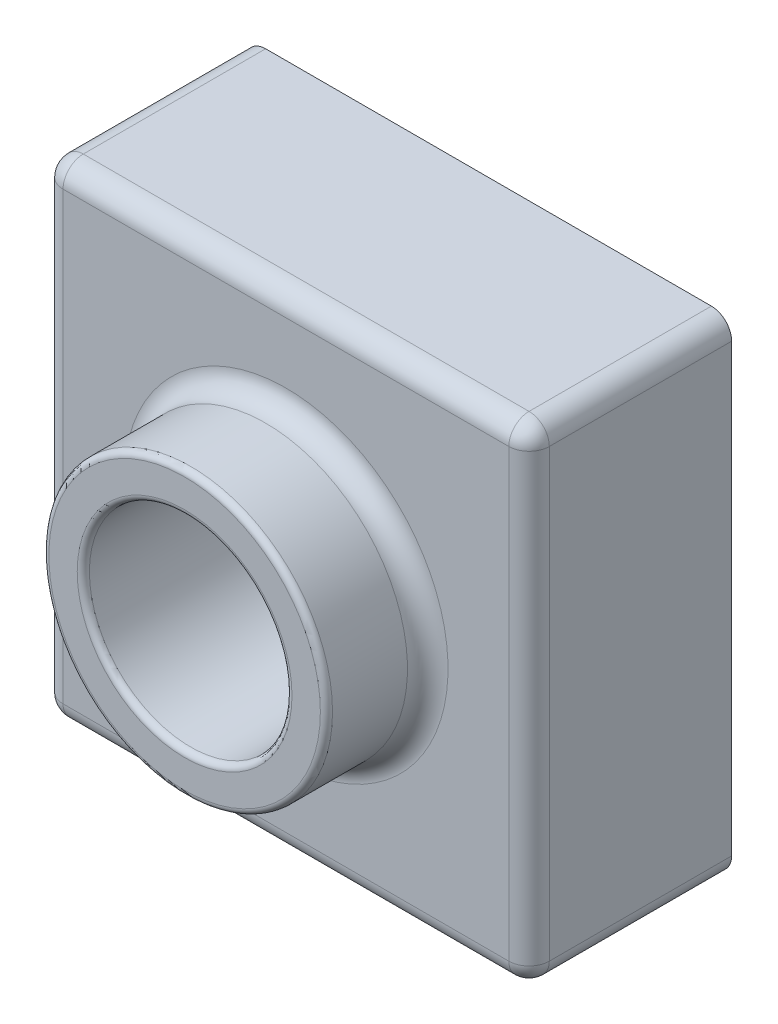
ISO-10303-21;
HEADER;
FILE_DESCRIPTION(('STEP AP214'),'2;1');
FILE_NAME('part.step','',(''),(''),'','','');
FILE_SCHEMA(('AUTOMOTIVE_DESIGN { 1 0 10303 214 1 1 1 1 }'));
ENDSEC;
DATA;
#1=APPLICATION_CONTEXT('core data for automotive mechanical design processes');
#2=APPLICATION_PROTOCOL_DEFINITION('international standard','automotive_design',2000,#1);
#3=PRODUCT_CONTEXT('',#1,'mechanical');
#4=PRODUCT('Part','Part','',(#3));
#5=PRODUCT_RELATED_PRODUCT_CATEGORY('part','',(#4));
#6=PRODUCT_DEFINITION_FORMATION('','',#4);
#7=PRODUCT_DEFINITION_CONTEXT('part definition',#1,'design');
#8=PRODUCT_DEFINITION('design','',#6,#7);
#9=PRODUCT_DEFINITION_SHAPE('','',#8);
#10=(LENGTH_UNIT() NAMED_UNIT(*) SI_UNIT(.MILLI.,.METRE.));
#11=(NAMED_UNIT(*) PLANE_ANGLE_UNIT() SI_UNIT($,.RADIAN.));
#12=(NAMED_UNIT(*) SI_UNIT($,.STERADIAN.) SOLID_ANGLE_UNIT());
#13=UNCERTAINTY_MEASURE_WITH_UNIT(LENGTH_MEASURE(1.E-05),#10,'distance_accuracy_value','');
#14=(GEOMETRIC_REPRESENTATION_CONTEXT(3) GLOBAL_UNCERTAINTY_ASSIGNED_CONTEXT((#13)) GLOBAL_UNIT_ASSIGNED_CONTEXT((#10,
#11,#12)) REPRESENTATION_CONTEXT('',''));
#15=CARTESIAN_POINT('',(0.,0.,0.));
#16=DIRECTION('',(0.,0.,1.));
#17=DIRECTION('',(1.,0.,0.));
#18=AXIS2_PLACEMENT_3D('',#15,#16,#17);
#19=CARTESIAN_POINT('',(0.,120.,0.));
#20=DIRECTION('',(0.,0.,-1.));
#21=DIRECTION('',(-1.,0.,0.));
#22=AXIS2_PLACEMENT_3D('',#19,#20,#21);
#23=PLANE('',#22);
#24=DIRECTION('',(1.,0.,0.));
#25=VECTOR('',#24,1.);
#26=CARTESIAN_POINT('',(0.,0.,0.));
#27=LINE('',#26,#25);
#28=CARTESIAN_POINT('',(5.,0.,0.));
#29=VERTEX_POINT('',#28);
#30=CARTESIAN_POINT('',(115.,0.,0.));
#31=VERTEX_POINT('',#30);
#32=EDGE_CURVE('E353',#29,#31,#27,.T.);
#33=ORIENTED_EDGE('',*,*,#32,.F.);
#34=CARTESIAN_POINT('',(5.,5.,0.));
#35=DIRECTION('',(0.,0.,-1.));
#36=DIRECTION('',(-1.,0.,0.));
#37=AXIS2_PLACEMENT_3D('',#34,#35,#36);
#38=CIRCLE('',#37,5.);
#39=CARTESIAN_POINT('',(0.,5.,0.));
#40=VERTEX_POINT('',#39);
#41=EDGE_CURVE('E431',#29,#40,#38,.T.);
#42=ORIENTED_EDGE('',*,*,#41,.T.);
#43=DIRECTION('',(0.,-1.,0.));
#44=VECTOR('',#43,1.);
#45=CARTESIAN_POINT('',(0.,0.,0.));
#46=LINE('',#45,#44);
#47=CARTESIAN_POINT('',(0.,115.,0.));
#48=VERTEX_POINT('',#47);
#49=EDGE_CURVE('E349',#48,#40,#46,.T.);
#50=ORIENTED_EDGE('',*,*,#49,.F.);
#51=CARTESIAN_POINT('',(5.,115.,0.));
#52=DIRECTION('',(0.,0.,-1.));
#53=DIRECTION('',(-1.,0.,0.));
#54=AXIS2_PLACEMENT_3D('',#51,#52,#53);
#55=CIRCLE('',#54,5.);
#56=CARTESIAN_POINT('',(5.,120.,0.));
#57=VERTEX_POINT('',#56);
#58=EDGE_CURVE('E422',#48,#57,#55,.T.);
#59=ORIENTED_EDGE('',*,*,#58,.T.);
#60=DIRECTION('',(-1.,0.,0.));
#61=VECTOR('',#60,1.);
#62=CARTESIAN_POINT('',(0.,120.,0.));
#63=LINE('',#62,#61);
#64=CARTESIAN_POINT('',(115.,120.,0.));
#65=VERTEX_POINT('',#64);
#66=EDGE_CURVE('E361',#65,#57,#63,.T.);
#67=ORIENTED_EDGE('',*,*,#66,.F.);
#68=CARTESIAN_POINT('',(115.,115.,0.));
#69=DIRECTION('',(0.,0.,-1.));
#70=DIRECTION('',(-1.,0.,0.));
#71=AXIS2_PLACEMENT_3D('',#68,#69,#70);
#72=CIRCLE('',#71,5.);
#73=CARTESIAN_POINT('',(120.,115.,0.));
#74=VERTEX_POINT('',#73);
#75=EDGE_CURVE('E425',#65,#74,#72,.T.);
#76=ORIENTED_EDGE('',*,*,#75,.T.);
#77=DIRECTION('',(0.,1.,0.));
#78=VECTOR('',#77,1.);
#79=CARTESIAN_POINT('',(120.,0.,0.));
#80=LINE('',#79,#78);
#81=CARTESIAN_POINT('',(120.,5.,0.));
#82=VERTEX_POINT('',#81);
#83=EDGE_CURVE('E357',#82,#74,#80,.T.);
#84=ORIENTED_EDGE('',*,*,#83,.F.);
#85=CARTESIAN_POINT('',(115.,5.,0.));
#86=DIRECTION('',(0.,0.,-1.));
#87=DIRECTION('',(-1.,0.,0.));
#88=AXIS2_PLACEMENT_3D('',#85,#86,#87);
#89=CIRCLE('',#88,5.);
#90=EDGE_CURVE('E428',#82,#31,#89,.T.);
#91=ORIENTED_EDGE('',*,*,#90,.T.);
#92=EDGE_LOOP('',(#33,#42,#50,#59,#67,#76,#84,#91));
#93=FACE_BOUND('',#92,.T.);
#94=CARTESIAN_POINT('',(5.,5.,0.));
#95=DIRECTION('',(0.,0.,-1.));
#96=DIRECTION('',(-1.,0.,0.));
#97=AXIS2_PLACEMENT_3D('',#94,#95,#96);
#98=CIRCLE('',#97,3.);
#99=CARTESIAN_POINT('',(5.,2.,0.));
#100=VERTEX_POINT('',#99);
#101=CARTESIAN_POINT('',(2.,5.,0.));
#102=VERTEX_POINT('',#101);
#103=EDGE_CURVE('E246',#100,#102,#98,.T.);
#104=ORIENTED_EDGE('',*,*,#103,.F.);
#105=DIRECTION('',(1.,0.,0.));
#106=VECTOR('',#105,1.);
#107=CARTESIAN_POINT('',(0.,2.,0.));
#108=LINE('',#107,#106);
#109=CARTESIAN_POINT('',(115.,2.,0.));
#110=VERTEX_POINT('',#109);
#111=EDGE_CURVE('E323',#100,#110,#108,.T.);
#112=ORIENTED_EDGE('',*,*,#111,.T.);
#113=CARTESIAN_POINT('',(115.,5.,0.));
#114=DIRECTION('',(0.,0.,-1.));
#115=DIRECTION('',(-1.,0.,0.));
#116=AXIS2_PLACEMENT_3D('',#113,#114,#115);
#117=CIRCLE('',#116,3.);
#118=CARTESIAN_POINT('',(118.,5.,0.));
#119=VERTEX_POINT('',#118);
#120=EDGE_CURVE('E329',#119,#110,#117,.T.);
#121=ORIENTED_EDGE('',*,*,#120,.F.);
#122=DIRECTION('',(0.,1.,0.));
#123=VECTOR('',#122,1.);
#124=CARTESIAN_POINT('',(118.,120.,0.));
#125=LINE('',#124,#123);
#126=CARTESIAN_POINT('',(118.,115.,0.));
#127=VERTEX_POINT('',#126);
#128=EDGE_CURVE('E61',#119,#127,#125,.T.);
#129=ORIENTED_EDGE('',*,*,#128,.T.);
#130=CARTESIAN_POINT('',(115.,115.,0.));
#131=DIRECTION('',(0.,0.,-1.));
#132=DIRECTION('',(-1.,0.,0.));
#133=AXIS2_PLACEMENT_3D('',#130,#131,#132);
#134=CIRCLE('',#133,3.);
#135=CARTESIAN_POINT('',(115.,118.,0.));
#136=VERTEX_POINT('',#135);
#137=EDGE_CURVE('E335',#136,#127,#134,.T.);
#138=ORIENTED_EDGE('',*,*,#137,.F.);
#139=DIRECTION('',(-1.,0.,0.));
#140=VECTOR('',#139,1.);
#141=CARTESIAN_POINT('',(0.,118.,0.));
#142=LINE('',#141,#140);
#143=CARTESIAN_POINT('',(5.,118.,0.));
#144=VERTEX_POINT('',#143);
#145=EDGE_CURVE('E240',#136,#144,#142,.T.);
#146=ORIENTED_EDGE('',*,*,#145,.T.);
#147=CARTESIAN_POINT('',(5.,115.,0.));
#148=DIRECTION('',(0.,0.,-1.));
#149=DIRECTION('',(-1.,0.,0.));
#150=AXIS2_PLACEMENT_3D('',#147,#148,#149);
#151=CIRCLE('',#150,3.);
#152=CARTESIAN_POINT('',(2.,115.,0.));
#153=VERTEX_POINT('',#152);
#154=EDGE_CURVE('E305',#153,#144,#151,.T.);
#155=ORIENTED_EDGE('',*,*,#154,.F.);
#156=DIRECTION('',(0.,-1.,0.));
#157=VECTOR('',#156,1.);
#158=CARTESIAN_POINT('',(2.,120.,0.));
#159=LINE('',#158,#157);
#160=EDGE_CURVE('E322',#153,#102,#159,.T.);
#161=ORIENTED_EDGE('',*,*,#160,.T.);
#162=EDGE_LOOP('',(#104,#112,#121,#129,#138,#146,#155,#161));
#163=FACE_BOUND('',#162,.T.);
#164=ADVANCED_FACE('F45',(#93,#163),#23,.T.);
#165=CARTESIAN_POINT('',(0.,120.,50.));
#166=DIRECTION('',(0.,0.,-1.));
#167=DIRECTION('',(-1.,0.,0.));
#168=AXIS2_PLACEMENT_3D('',#165,#166,#167);
#169=PLANE('',#168);
#170=CARTESIAN_POINT('',(60.,60.,50.));
#171=DIRECTION('',(0.,0.,-1.));
#172=DIRECTION('',(-1.,0.,0.));
#173=AXIS2_PLACEMENT_3D('',#170,#171,#172);
#174=CIRCLE('',#173,40.);
#175=CARTESIAN_POINT('',(20.,60.,50.));
#176=VERTEX_POINT('',#175);
#177=EDGE_CURVE('E382',#176,#176,#174,.T.);
#178=ORIENTED_EDGE('',*,*,#177,.T.);
#179=EDGE_LOOP('',(#178));
#180=FACE_BOUND('',#179,.T.);
#181=DIRECTION('',(0.,1.,0.));
#182=VECTOR('',#181,1.);
#183=CARTESIAN_POINT('',(115.,120.,50.));
#184=LINE('',#183,#182);
#185=CARTESIAN_POINT('',(115.,5.,50.));
#186=VERTEX_POINT('',#185);
#187=CARTESIAN_POINT('',(115.,115.,50.));
#188=VERTEX_POINT('',#187);
#189=EDGE_CURVE('E375',#186,#188,#184,.T.);
#190=ORIENTED_EDGE('',*,*,#189,.T.);
#191=DIRECTION('',(-1.,0.,0.));
#192=VECTOR('',#191,1.);
#193=CARTESIAN_POINT('',(0.,115.,50.));
#194=LINE('',#193,#192);
#195=CARTESIAN_POINT('',(5.,115.,50.));
#196=VERTEX_POINT('',#195);
#197=EDGE_CURVE('E378',#188,#196,#194,.T.);
#198=ORIENTED_EDGE('',*,*,#197,.T.);
#199=DIRECTION('',(0.,-1.,0.));
#200=VECTOR('',#199,1.);
#201=CARTESIAN_POINT('',(5.,120.,50.));
#202=LINE('',#201,#200);
#203=CARTESIAN_POINT('',(5.,5.,50.));
#204=VERTEX_POINT('',#203);
#205=EDGE_CURVE('E369',#196,#204,#202,.T.);
#206=ORIENTED_EDGE('',*,*,#205,.T.);
#207=DIRECTION('',(1.,0.,0.));
#208=VECTOR('',#207,1.);
#209=CARTESIAN_POINT('',(0.,5.,50.));
#210=LINE('',#209,#208);
#211=EDGE_CURVE('E372',#204,#186,#210,.T.);
#212=ORIENTED_EDGE('',*,*,#211,.T.);
#213=EDGE_LOOP('',(#190,#198,#206,#212));
#214=FACE_BOUND('',#213,.T.);
#215=ADVANCED_FACE('F531',(#180,#214),#169,.F.);
#216=CARTESIAN_POINT('',(0.,0.,50.));
#217=DIRECTION('',(1.,0.,0.));
#218=DIRECTION('',(0.,0.,-1.));
#219=AXIS2_PLACEMENT_3D('',#216,#217,#218);
#220=PLANE('',#219);
#221=ORIENTED_EDGE('',*,*,#49,.T.);
#222=DIRECTION('',(0.,0.,-1.));
#223=VECTOR('',#222,1.);
#224=CARTESIAN_POINT('',(0.,5.,50.));
#225=LINE('',#224,#223);
#226=CARTESIAN_POINT('',(0.,5.,45.));
#227=VERTEX_POINT('',#226);
#228=EDGE_CURVE('E69',#40,#227,#225,.F.);
#229=ORIENTED_EDGE('',*,*,#228,.T.);
#230=DIRECTION('',(0.,-1.,0.));
#231=VECTOR('',#230,1.);
#232=CARTESIAN_POINT('',(0.,0.,45.));
#233=LINE('',#232,#231);
#234=CARTESIAN_POINT('',(0.,115.,45.));
#235=VERTEX_POINT('',#234);
#236=EDGE_CURVE('E417',#227,#235,#233,.F.);
#237=ORIENTED_EDGE('',*,*,#236,.T.);
#238=DIRECTION('',(0.,0.,-1.));
#239=VECTOR('',#238,1.);
#240=CARTESIAN_POINT('',(0.,115.,50.));
#241=LINE('',#240,#239);
#242=EDGE_CURVE('E414',#235,#48,#241,.T.);
#243=ORIENTED_EDGE('',*,*,#242,.T.);
#244=EDGE_LOOP('',(#221,#229,#237,#243));
#245=FACE_BOUND('',#244,.T.);
#246=ADVANCED_FACE('F536',(#245),#220,.F.);
#247=CARTESIAN_POINT('',(0.,0.,50.));
#248=DIRECTION('',(0.,1.,0.));
#249=DIRECTION('',(0.,0.,1.));
#250=AXIS2_PLACEMENT_3D('',#247,#248,#249);
#251=PLANE('',#250);
#252=DIRECTION('',(1.,0.,0.));
#253=VECTOR('',#252,1.);
#254=CARTESIAN_POINT('',(0.,0.,45.));
#255=LINE('',#254,#253);
#256=CARTESIAN_POINT('',(115.,0.,45.));
#257=VERTEX_POINT('',#256);
#258=CARTESIAN_POINT('',(5.,0.,45.));
#259=VERTEX_POINT('',#258);
#260=EDGE_CURVE('E408',#257,#259,#255,.F.);
#261=ORIENTED_EDGE('',*,*,#260,.T.);
#262=DIRECTION('',(0.,0.,-1.));
#263=VECTOR('',#262,1.);
#264=CARTESIAN_POINT('',(5.,0.,50.));
#265=LINE('',#264,#263);
#266=EDGE_CURVE('E411',#259,#29,#265,.T.);
#267=ORIENTED_EDGE('',*,*,#266,.T.);
#268=ORIENTED_EDGE('',*,*,#32,.T.);
#269=DIRECTION('',(0.,0.,-1.));
#270=VECTOR('',#269,1.);
#271=CARTESIAN_POINT('',(115.,0.,50.));
#272=LINE('',#271,#270);
#273=EDGE_CURVE('E405',#31,#257,#272,.F.);
#274=ORIENTED_EDGE('',*,*,#273,.T.);
#275=EDGE_LOOP('',(#261,#267,#268,#274));
#276=FACE_BOUND('',#275,.T.);
#277=ADVANCED_FACE('F1013',(#276),#251,.F.);
#278=CARTESIAN_POINT('',(120.,0.,50.));
#279=DIRECTION('',(-1.,0.,0.));
#280=DIRECTION('',(0.,0.,1.));
#281=AXIS2_PLACEMENT_3D('',#278,#279,#280);
#282=PLANE('',#281);
#283=DIRECTION('',(0.,1.,0.));
#284=VECTOR('',#283,1.);
#285=CARTESIAN_POINT('',(120.,0.,45.));
#286=LINE('',#285,#284);
#287=CARTESIAN_POINT('',(120.,115.,45.));
#288=VERTEX_POINT('',#287);
#289=CARTESIAN_POINT('',(120.,5.,45.));
#290=VERTEX_POINT('',#289);
#291=EDGE_CURVE('E399',#288,#290,#286,.F.);
#292=ORIENTED_EDGE('',*,*,#291,.T.);
#293=DIRECTION('',(0.,0.,-1.));
#294=VECTOR('',#293,1.);
#295=CARTESIAN_POINT('',(120.,5.,50.));
#296=LINE('',#295,#294);
#297=EDGE_CURVE('E402',#290,#82,#296,.T.);
#298=ORIENTED_EDGE('',*,*,#297,.T.);
#299=ORIENTED_EDGE('',*,*,#83,.T.);
#300=DIRECTION('',(0.,0.,-1.));
#301=VECTOR('',#300,1.);
#302=CARTESIAN_POINT('',(120.,115.,50.));
#303=LINE('',#302,#301);
#304=EDGE_CURVE('E396',#74,#288,#303,.F.);
#305=ORIENTED_EDGE('',*,*,#304,.T.);
#306=EDGE_LOOP('',(#292,#298,#299,#305));
#307=FACE_BOUND('',#306,.T.);
#308=ADVANCED_FACE('F525',(#307),#282,.F.);
#309=CARTESIAN_POINT('',(0.,120.,50.));
#310=DIRECTION('',(0.,-1.,0.));
#311=DIRECTION('',(0.,0.,-1.));
#312=AXIS2_PLACEMENT_3D('',#309,#310,#311);
#313=PLANE('',#312);
#314=DIRECTION('',(-1.,0.,0.));
#315=VECTOR('',#314,1.);
#316=CARTESIAN_POINT('',(0.,120.,45.));
#317=LINE('',#316,#315);
#318=CARTESIAN_POINT('',(5.,120.,45.));
#319=VERTEX_POINT('',#318);
#320=CARTESIAN_POINT('',(115.,120.,45.));
#321=VERTEX_POINT('',#320);
#322=EDGE_CURVE('E389',#319,#321,#317,.F.);
#323=ORIENTED_EDGE('',*,*,#322,.T.);
#324=DIRECTION('',(0.,0.,-1.));
#325=VECTOR('',#324,1.);
#326=CARTESIAN_POINT('',(115.,120.,50.));
#327=LINE('',#326,#325);
#328=EDGE_CURVE('E393',#321,#65,#327,.T.);
#329=ORIENTED_EDGE('',*,*,#328,.T.);
#330=ORIENTED_EDGE('',*,*,#66,.T.);
#331=DIRECTION('',(0.,0.,-1.));
#332=VECTOR('',#331,1.);
#333=CARTESIAN_POINT('',(5.,120.,50.));
#334=LINE('',#333,#332);
#335=EDGE_CURVE('E386',#57,#319,#334,.F.);
#336=ORIENTED_EDGE('',*,*,#335,.T.);
#337=EDGE_LOOP('',(#323,#329,#330,#336));
#338=FACE_BOUND('',#337,.T.);
#339=ADVANCED_FACE('F517',(#338),#313,.F.);
#340=CARTESIAN_POINT('',(60.,60.,0.));
#341=DIRECTION('',(0.,0.,-1.));
#342=DIRECTION('',(-1.,0.,0.));
#343=AXIS2_PLACEMENT_3D('',#340,#341,#342);
#344=CIRCLE('',#343,27.);
#345=CARTESIAN_POINT('',(33.,60.,0.));
#346=VERTEX_POINT('',#345);
#347=EDGE_CURVE('E278',#346,#346,#344,.F.);
#348=ORIENTED_EDGE('',*,*,#347,.F.);
#349=EDGE_LOOP('',(#348));
#350=FACE_BOUND('',#349,.T.);
#351=CARTESIAN_POINT('',(60.,60.,0.));
#352=DIRECTION('',(0.,0.,1.));
#353=DIRECTION('',(1.,0.,0.));
#354=AXIS2_PLACEMENT_3D('',#351,#352,#353);
#355=CIRCLE('',#354,25.);
#356=CARTESIAN_POINT('',(85.,60.,0.));
#357=VERTEX_POINT('',#356);
#358=EDGE_CURVE('E345',#357,#357,#355,.T.);
#359=ORIENTED_EDGE('',*,*,#358,.T.);
#360=EDGE_LOOP('',(#359));
#361=FACE_BOUND('',#360,.T.);
#362=ADVANCED_FACE('F515',(#350,#361),#23,.T.);
#363=CARTESIAN_POINT('',(60.,60.,75.));
#364=DIRECTION('',(0.,0.,-1.));
#365=DIRECTION('',(-1.,0.,0.));
#366=AXIS2_PLACEMENT_3D('',#363,#364,#365);
#367=CYLINDRICAL_SURFACE('',#366,35.);
#368=CARTESIAN_POINT('',(60.,60.,73.5));
#369=DIRECTION('',(0.,0.,1.));
#370=DIRECTION('',(1.,0.,0.));
#371=AXIS2_PLACEMENT_3D('',#368,#369,#370);
#372=CIRCLE('',#371,35.);
#373=CARTESIAN_POINT('',(95.,60.,73.5));
#374=VERTEX_POINT('',#373);
#375=EDGE_CURVE('E54',#374,#374,#372,.F.);
#376=ORIENTED_EDGE('',*,*,#375,.T.);
#377=EDGE_LOOP('',(#376));
#378=FACE_BOUND('',#377,.T.);
#379=CARTESIAN_POINT('',(60.,60.,55.));
#380=DIRECTION('',(0.,0.,-1.));
#381=DIRECTION('',(-1.,0.,0.));
#382=AXIS2_PLACEMENT_3D('',#379,#380,#381);
#383=CIRCLE('',#382,35.);
#384=CARTESIAN_POINT('',(25.,60.,55.));
#385=VERTEX_POINT('',#384);
#386=EDGE_CURVE('E365',#385,#385,#383,.F.);
#387=ORIENTED_EDGE('',*,*,#386,.T.);
#388=EDGE_LOOP('',(#387));
#389=FACE_BOUND('',#388,.T.);
#390=ADVANCED_FACE('F489',(#378,#389),#367,.T.);
#391=CARTESIAN_POINT('',(60.,60.,75.));
#392=DIRECTION('',(0.,0.,1.));
#393=DIRECTION('',(1.,0.,0.));
#394=AXIS2_PLACEMENT_3D('',#391,#392,#393);
#395=PLANE('',#394);
#396=CARTESIAN_POINT('',(60.,60.,75.));
#397=DIRECTION('',(0.,0.,1.));
#398=DIRECTION('',(1.,0.,0.));
#399=AXIS2_PLACEMENT_3D('',#396,#397,#398);
#400=CIRCLE('',#399,33.5);
#401=CARTESIAN_POINT('',(93.5,60.,75.));
#402=VERTEX_POINT('',#401);
#403=EDGE_CURVE('E482',#402,#402,#400,.T.);
#404=ORIENTED_EDGE('',*,*,#403,.T.);
#405=EDGE_LOOP('',(#404));
#406=FACE_BOUND('',#405,.T.);
#407=CARTESIAN_POINT('',(60.,60.,75.));
#408=DIRECTION('',(0.,0.,1.));
#409=DIRECTION('',(1.,0.,0.));
#410=AXIS2_PLACEMENT_3D('',#407,#408,#409);
#411=CIRCLE('',#410,26.5);
#412=CARTESIAN_POINT('',(86.5,60.,75.));
#413=VERTEX_POINT('',#412);
#414=EDGE_CURVE('E434',#413,#413,#411,.F.);
#415=ORIENTED_EDGE('',*,*,#414,.T.);
#416=EDGE_LOOP('',(#415));
#417=FACE_BOUND('',#416,.T.);
#418=ADVANCED_FACE('F498',(#406,#417),#395,.T.);
#419=CARTESIAN_POINT('',(60.,60.,0.));
#420=DIRECTION('',(0.,0.,1.));
#421=DIRECTION('',(1.,0.,0.));
#422=AXIS2_PLACEMENT_3D('',#419,#420,#421);
#423=CYLINDRICAL_SURFACE('',#422,25.);
#424=CARTESIAN_POINT('',(60.,60.,73.5));
#425=DIRECTION('',(0.,0.,1.));
#426=DIRECTION('',(1.,0.,0.));
#427=AXIS2_PLACEMENT_3D('',#424,#425,#426);
#428=CIRCLE('',#427,25.);
#429=CARTESIAN_POINT('',(85.,60.,73.5));
#430=VERTEX_POINT('',#429);
#431=EDGE_CURVE('E11',#430,#430,#428,.T.);
#432=ORIENTED_EDGE('',*,*,#431,.T.);
#433=EDGE_LOOP('',(#432));
#434=FACE_BOUND('',#433,.T.);
#435=ORIENTED_EDGE('',*,*,#358,.F.);
#436=EDGE_LOOP('',(#435));
#437=FACE_BOUND('',#436,.T.);
#438=ADVANCED_FACE('F501',(#434,#437),#423,.F.);
#439=CARTESIAN_POINT('',(60.,60.,55.));
#440=DIRECTION('',(0.,0.,-1.));
#441=DIRECTION('',(-1.,0.,0.));
#442=AXIS2_PLACEMENT_3D('',#439,#440,#441);
#443=TOROIDAL_SURFACE('',#442,40.,5.);
#444=ORIENTED_EDGE('',*,*,#177,.F.);
#445=EDGE_LOOP('',(#444));
#446=FACE_BOUND('',#445,.T.);
#447=ORIENTED_EDGE('',*,*,#386,.F.);
#448=EDGE_LOOP('',(#447));
#449=FACE_BOUND('',#448,.T.);
#450=ADVANCED_FACE('F511',(#446,#449),#443,.F.);
#451=CARTESIAN_POINT('',(115.,5.,50.));
#452=DIRECTION('',(0.,0.,-1.));
#453=DIRECTION('',(-1.,0.,0.));
#454=AXIS2_PLACEMENT_3D('',#451,#452,#453);
#455=CYLINDRICAL_SURFACE('',#454,5.);
#456=ORIENTED_EDGE('',*,*,#90,.F.);
#457=ORIENTED_EDGE('',*,*,#297,.F.);
#458=CARTESIAN_POINT('',(115.,5.,45.));
#459=DIRECTION('',(0.,0.,1.));
#460=DIRECTION('',(1.,0.,0.));
#461=AXIS2_PLACEMENT_3D('',#458,#459,#460);
#462=CIRCLE('',#461,5.);
#463=EDGE_CURVE('E350',#257,#290,#462,.T.);
#464=ORIENTED_EDGE('',*,*,#463,.F.);
#465=ORIENTED_EDGE('',*,*,#273,.F.);
#466=EDGE_LOOP('',(#456,#457,#464,#465));
#467=FACE_BOUND('',#466,.T.);
#468=ADVANCED_FACE('F948',(#467),#455,.T.);
#469=CARTESIAN_POINT('',(0.,5.,45.));
#470=DIRECTION('',(1.,0.,0.));
#471=DIRECTION('',(0.,0.,-1.));
#472=AXIS2_PLACEMENT_3D('',#469,#470,#471);
#473=CYLINDRICAL_SURFACE('',#472,5.);
#474=CARTESIAN_POINT('',(5.,5.,45.));
#475=DIRECTION('',(-1.,0.,0.));
#476=DIRECTION('',(0.,0.,1.));
#477=AXIS2_PLACEMENT_3D('',#474,#475,#476);
#478=CIRCLE('',#477,5.);
#479=EDGE_CURVE('E468',#259,#204,#478,.T.);
#480=ORIENTED_EDGE('',*,*,#479,.F.);
#481=ORIENTED_EDGE('',*,*,#260,.F.);
#482=CARTESIAN_POINT('',(115.,5.,45.));
#483=DIRECTION('',(1.,0.,0.));
#484=DIRECTION('',(0.,0.,-1.));
#485=AXIS2_PLACEMENT_3D('',#482,#483,#484);
#486=CIRCLE('',#485,5.);
#487=EDGE_CURVE('E472',#186,#257,#486,.T.);
#488=ORIENTED_EDGE('',*,*,#487,.F.);
#489=ORIENTED_EDGE('',*,*,#211,.F.);
#490=EDGE_LOOP('',(#480,#481,#488,#489));
#491=FACE_BOUND('',#490,.T.);
#492=ADVANCED_FACE('F938',(#491),#473,.T.);
#493=CARTESIAN_POINT('',(5.,5.,50.));
#494=DIRECTION('',(0.,0.,-1.));
#495=DIRECTION('',(-1.,0.,0.));
#496=AXIS2_PLACEMENT_3D('',#493,#494,#495);
#497=CYLINDRICAL_SURFACE('',#496,5.);
#498=ORIENTED_EDGE('',*,*,#41,.F.);
#499=ORIENTED_EDGE('',*,*,#266,.F.);
#500=CARTESIAN_POINT('',(5.,5.,45.));
#501=DIRECTION('',(0.,0.,1.));
#502=DIRECTION('',(1.,0.,0.));
#503=AXIS2_PLACEMENT_3D('',#500,#501,#502);
#504=CIRCLE('',#503,5.);
#505=EDGE_CURVE('E464',#227,#259,#504,.T.);
#506=ORIENTED_EDGE('',*,*,#505,.F.);
#507=ORIENTED_EDGE('',*,*,#228,.F.);
#508=EDGE_LOOP('',(#498,#499,#506,#507));
#509=FACE_BOUND('',#508,.T.);
#510=ADVANCED_FACE('F928',(#509),#497,.T.);
#511=CARTESIAN_POINT('',(115.,5.,45.));
#512=DIRECTION('',(0.,0.,1.));
#513=DIRECTION('',(1.,0.,0.));
#514=AXIS2_PLACEMENT_3D('',#511,#512,#513);
#515=SPHERICAL_SURFACE('',#514,5.);
#516=ORIENTED_EDGE('',*,*,#487,.T.);
#517=ORIENTED_EDGE('',*,*,#463,.T.);
#518=CARTESIAN_POINT('',(115.,5.,45.));
#519=DIRECTION('',(0.,-1.,0.));
#520=DIRECTION('',(0.,0.,-1.));
#521=AXIS2_PLACEMENT_3D('',#518,#519,#520);
#522=CIRCLE('',#521,5.);
#523=EDGE_CURVE('E460',#186,#290,#522,.F.);
#524=ORIENTED_EDGE('',*,*,#523,.F.);
#525=EDGE_LOOP('',(#516,#517,#524));
#526=FACE_BOUND('',#525,.T.);
#527=ADVANCED_FACE('F918',(#526),#515,.T.);
#528=CARTESIAN_POINT('',(5.,5.,45.));
#529=DIRECTION('',(0.,0.,1.));
#530=DIRECTION('',(1.,0.,0.));
#531=AXIS2_PLACEMENT_3D('',#528,#529,#530);
#532=SPHERICAL_SURFACE('',#531,5.);
#533=ORIENTED_EDGE('',*,*,#505,.T.);
#534=ORIENTED_EDGE('',*,*,#479,.T.);
#535=CARTESIAN_POINT('',(5.,5.,45.));
#536=DIRECTION('',(0.,-1.,0.));
#537=DIRECTION('',(1.,0.,0.));
#538=AXIS2_PLACEMENT_3D('',#535,#536,#537);
#539=CIRCLE('',#538,5.);
#540=EDGE_CURVE('E456',#227,#204,#539,.F.);
#541=ORIENTED_EDGE('',*,*,#540,.F.);
#542=EDGE_LOOP('',(#533,#534,#541));
#543=FACE_BOUND('',#542,.T.);
#544=ADVANCED_FACE('F908',(#543),#532,.T.);
#545=CARTESIAN_POINT('',(115.,115.,50.));
#546=DIRECTION('',(0.,0.,-1.));
#547=DIRECTION('',(-1.,0.,0.));
#548=AXIS2_PLACEMENT_3D('',#545,#546,#547);
#549=CYLINDRICAL_SURFACE('',#548,5.);
#550=ORIENTED_EDGE('',*,*,#75,.F.);
#551=ORIENTED_EDGE('',*,*,#328,.F.);
#552=CARTESIAN_POINT('',(115.,115.,45.));
#553=DIRECTION('',(0.,0.,1.));
#554=DIRECTION('',(1.,0.,0.));
#555=AXIS2_PLACEMENT_3D('',#552,#553,#554);
#556=CIRCLE('',#555,5.);
#557=EDGE_CURVE('E452',#288,#321,#556,.T.);
#558=ORIENTED_EDGE('',*,*,#557,.F.);
#559=ORIENTED_EDGE('',*,*,#304,.F.);
#560=EDGE_LOOP('',(#550,#551,#558,#559));
#561=FACE_BOUND('',#560,.T.);
#562=ADVANCED_FACE('F898',(#561),#549,.T.);
#563=CARTESIAN_POINT('',(115.,120.,45.));
#564=DIRECTION('',(0.,1.,0.));
#565=DIRECTION('',(0.,0.,1.));
#566=AXIS2_PLACEMENT_3D('',#563,#564,#565);
#567=CYLINDRICAL_SURFACE('',#566,5.);
#568=ORIENTED_EDGE('',*,*,#523,.T.);
#569=ORIENTED_EDGE('',*,*,#291,.F.);
#570=CARTESIAN_POINT('',(115.,115.,45.));
#571=DIRECTION('',(0.,1.,0.));
#572=DIRECTION('',(0.,0.,1.));
#573=AXIS2_PLACEMENT_3D('',#570,#571,#572);
#574=CIRCLE('',#573,5.);
#575=EDGE_CURVE('E448',#188,#288,#574,.T.);
#576=ORIENTED_EDGE('',*,*,#575,.F.);
#577=ORIENTED_EDGE('',*,*,#189,.F.);
#578=EDGE_LOOP('',(#568,#569,#576,#577));
#579=FACE_BOUND('',#578,.T.);
#580=ADVANCED_FACE('F888',(#579),#567,.T.);
#581=CARTESIAN_POINT('',(5.,120.,45.));
#582=DIRECTION('',(0.,-1.,0.));
#583=DIRECTION('',(0.,0.,-1.));
#584=AXIS2_PLACEMENT_3D('',#581,#582,#583);
#585=CYLINDRICAL_SURFACE('',#584,5.);
#586=ORIENTED_EDGE('',*,*,#540,.T.);
#587=ORIENTED_EDGE('',*,*,#205,.F.);
#588=CARTESIAN_POINT('',(5.,115.,45.));
#589=DIRECTION('',(0.,1.,0.));
#590=DIRECTION('',(0.,0.,1.));
#591=AXIS2_PLACEMENT_3D('',#588,#589,#590);
#592=CIRCLE('',#591,5.);
#593=EDGE_CURVE('E444',#235,#196,#592,.T.);
#594=ORIENTED_EDGE('',*,*,#593,.F.);
#595=ORIENTED_EDGE('',*,*,#236,.F.);
#596=EDGE_LOOP('',(#586,#587,#594,#595));
#597=FACE_BOUND('',#596,.T.);
#598=ADVANCED_FACE('F878',(#597),#585,.T.);
#599=CARTESIAN_POINT('',(5.,115.,50.));
#600=DIRECTION('',(0.,0.,-1.));
#601=DIRECTION('',(-1.,0.,0.));
#602=AXIS2_PLACEMENT_3D('',#599,#600,#601);
#603=CYLINDRICAL_SURFACE('',#602,5.);
#604=ORIENTED_EDGE('',*,*,#58,.F.);
#605=ORIENTED_EDGE('',*,*,#242,.F.);
#606=CARTESIAN_POINT('',(5.,115.,45.));
#607=DIRECTION('',(0.,0.,1.));
#608=DIRECTION('',(1.,0.,0.));
#609=AXIS2_PLACEMENT_3D('',#606,#607,#608);
#610=CIRCLE('',#609,5.);
#611=EDGE_CURVE('E440',#319,#235,#610,.T.);
#612=ORIENTED_EDGE('',*,*,#611,.F.);
#613=ORIENTED_EDGE('',*,*,#335,.F.);
#614=EDGE_LOOP('',(#604,#605,#612,#613));
#615=FACE_BOUND('',#614,.T.);
#616=ADVANCED_FACE('F868',(#615),#603,.T.);
#617=CARTESIAN_POINT('',(115.,115.,45.));
#618=DIRECTION('',(0.,0.,1.));
#619=DIRECTION('',(1.,0.,0.));
#620=AXIS2_PLACEMENT_3D('',#617,#618,#619);
#621=SPHERICAL_SURFACE('',#620,5.);
#622=ORIENTED_EDGE('',*,*,#575,.T.);
#623=ORIENTED_EDGE('',*,*,#557,.T.);
#624=CARTESIAN_POINT('',(115.,115.,45.));
#625=DIRECTION('',(1.,0.,0.));
#626=DIRECTION('',(0.,0.,-1.));
#627=AXIS2_PLACEMENT_3D('',#624,#625,#626);
#628=CIRCLE('',#627,5.);
#629=EDGE_CURVE('E437',#188,#321,#628,.F.);
#630=ORIENTED_EDGE('',*,*,#629,.F.);
#631=EDGE_LOOP('',(#622,#623,#630));
#632=FACE_BOUND('',#631,.T.);
#633=ADVANCED_FACE('F858',(#632),#621,.T.);
#634=CARTESIAN_POINT('',(5.,115.,45.));
#635=DIRECTION('',(0.,0.,1.));
#636=DIRECTION('',(1.,0.,0.));
#637=AXIS2_PLACEMENT_3D('',#634,#635,#636);
#638=SPHERICAL_SURFACE('',#637,5.);
#639=ORIENTED_EDGE('',*,*,#611,.T.);
#640=ORIENTED_EDGE('',*,*,#593,.T.);
#641=CARTESIAN_POINT('',(5.,115.,45.));
#642=DIRECTION('',(-1.,0.,0.));
#643=DIRECTION('',(0.,0.,1.));
#644=AXIS2_PLACEMENT_3D('',#641,#642,#643);
#645=CIRCLE('',#644,5.);
#646=EDGE_CURVE('E250',#319,#196,#645,.F.);
#647=ORIENTED_EDGE('',*,*,#646,.F.);
#648=EDGE_LOOP('',(#639,#640,#647));
#649=FACE_BOUND('',#648,.T.);
#650=ADVANCED_FACE('F848',(#649),#638,.T.);
#651=CARTESIAN_POINT('',(0.,115.,45.));
#652=DIRECTION('',(-1.,0.,0.));
#653=DIRECTION('',(0.,0.,1.));
#654=AXIS2_PLACEMENT_3D('',#651,#652,#653);
#655=CYLINDRICAL_SURFACE('',#654,5.);
#656=ORIENTED_EDGE('',*,*,#629,.T.);
#657=ORIENTED_EDGE('',*,*,#322,.F.);
#658=ORIENTED_EDGE('',*,*,#646,.T.);
#659=ORIENTED_EDGE('',*,*,#197,.F.);
#660=EDGE_LOOP('',(#656,#657,#658,#659));
#661=FACE_BOUND('',#660,.T.);
#662=ADVANCED_FACE('F495',(#661),#655,.T.);
#663=CARTESIAN_POINT('',(60.,60.,73.5));
#664=DIRECTION('',(0.,0.,1.));
#665=DIRECTION('',(1.,0.,0.));
#666=AXIS2_PLACEMENT_3D('',#663,#664,#665);
#667=TOROIDAL_SURFACE('',#666,33.5,1.5);
#668=ORIENTED_EDGE('',*,*,#375,.F.);
#669=EDGE_LOOP('',(#668));
#670=FACE_BOUND('',#669,.T.);
#671=ORIENTED_EDGE('',*,*,#403,.F.);
#672=EDGE_LOOP('',(#671));
#673=FACE_BOUND('',#672,.T.);
#674=ADVANCED_FACE('F492',(#670,#673),#667,.T.);
#675=CARTESIAN_POINT('',(60.,60.,73.5));
#676=DIRECTION('',(0.,0.,1.));
#677=DIRECTION('',(1.,0.,0.));
#678=AXIS2_PLACEMENT_3D('',#675,#676,#677);
#679=TOROIDAL_SURFACE('',#678,26.5,1.5);
#680=ORIENTED_EDGE('',*,*,#414,.F.);
#681=EDGE_LOOP('',(#680));
#682=FACE_BOUND('',#681,.T.);
#683=ORIENTED_EDGE('',*,*,#431,.F.);
#684=EDGE_LOOP('',(#683));
#685=FACE_BOUND('',#684,.T.);
#686=ADVANCED_FACE('F47',(#682,#685),#679,.T.);
#687=CARTESIAN_POINT('',(0.,120.,48.));
#688=DIRECTION('',(0.,0.,-1.));
#689=DIRECTION('',(-1.,0.,0.));
#690=AXIS2_PLACEMENT_3D('',#687,#688,#689);
#691=PLANE('',#690);
#692=CARTESIAN_POINT('',(60.,60.,48.));
#693=DIRECTION('',(0.,0.,-1.));
#694=DIRECTION('',(-1.,0.,0.));
#695=AXIS2_PLACEMENT_3D('',#692,#693,#694);
#696=CIRCLE('',#695,40.);
#697=CARTESIAN_POINT('',(20.,60.,48.));
#698=VERTEX_POINT('',#697);
#699=EDGE_CURVE('E225',#698,#698,#696,.T.);
#700=ORIENTED_EDGE('',*,*,#699,.F.);
#701=EDGE_LOOP('',(#700));
#702=FACE_BOUND('',#701,.T.);
#703=DIRECTION('',(0.,1.,0.));
#704=VECTOR('',#703,1.);
#705=CARTESIAN_POINT('',(115.,120.,48.));
#706=LINE('',#705,#704);
#707=CARTESIAN_POINT('',(115.,5.,48.));
#708=VERTEX_POINT('',#707);
#709=CARTESIAN_POINT('',(115.,115.,48.));
#710=VERTEX_POINT('',#709);
#711=EDGE_CURVE('E187',#708,#710,#706,.T.);
#712=ORIENTED_EDGE('',*,*,#711,.F.);
#713=DIRECTION('',(-1.,0.,0.));
#714=VECTOR('',#713,1.);
#715=CARTESIAN_POINT('',(0.,5.,48.));
#716=LINE('',#715,#714);
#717=CARTESIAN_POINT('',(5.,5.,48.));
#718=VERTEX_POINT('',#717);
#719=EDGE_CURVE('E198',#718,#708,#716,.F.);
#720=ORIENTED_EDGE('',*,*,#719,.F.);
#721=DIRECTION('',(0.,1.,0.));
#722=VECTOR('',#721,1.);
#723=CARTESIAN_POINT('',(5.,120.,48.));
#724=LINE('',#723,#722);
#725=CARTESIAN_POINT('',(5.,115.,48.));
#726=VERTEX_POINT('',#725);
#727=EDGE_CURVE('E223',#726,#718,#724,.F.);
#728=ORIENTED_EDGE('',*,*,#727,.F.);
#729=DIRECTION('',(-1.,0.,0.));
#730=VECTOR('',#729,1.);
#731=CARTESIAN_POINT('',(0.,115.,48.));
#732=LINE('',#731,#730);
#733=EDGE_CURVE('E197',#710,#726,#732,.T.);
#734=ORIENTED_EDGE('',*,*,#733,.F.);
#735=EDGE_LOOP('',(#712,#720,#728,#734));
#736=FACE_BOUND('',#735,.T.);
#737=ADVANCED_FACE('F222',(#702,#736),#691,.T.);
#738=CARTESIAN_POINT('',(2.,0.,50.));
#739=DIRECTION('',(1.,0.,0.));
#740=DIRECTION('',(0.,0.,-1.));
#741=AXIS2_PLACEMENT_3D('',#738,#739,#740);
#742=PLANE('',#741);
#743=ORIENTED_EDGE('',*,*,#160,.F.);
#744=DIRECTION('',(0.,0.,-1.));
#745=VECTOR('',#744,1.);
#746=CARTESIAN_POINT('',(2.,115.,50.));
#747=LINE('',#746,#745);
#748=CARTESIAN_POINT('',(2.,115.,45.));
#749=VERTEX_POINT('',#748);
#750=EDGE_CURVE('E268',#749,#153,#747,.T.);
#751=ORIENTED_EDGE('',*,*,#750,.F.);
#752=DIRECTION('',(0.,1.,0.));
#753=VECTOR('',#752,1.);
#754=CARTESIAN_POINT('',(2.,0.,45.));
#755=LINE('',#754,#753);
#756=CARTESIAN_POINT('',(2.,5.,45.));
#757=VERTEX_POINT('',#756);
#758=EDGE_CURVE('E298',#757,#749,#755,.T.);
#759=ORIENTED_EDGE('',*,*,#758,.F.);
#760=DIRECTION('',(0.,0.,-1.));
#761=VECTOR('',#760,1.);
#762=CARTESIAN_POINT('',(2.,5.,50.));
#763=LINE('',#762,#761);
#764=EDGE_CURVE('E302',#102,#757,#763,.F.);
#765=ORIENTED_EDGE('',*,*,#764,.F.);
#766=EDGE_LOOP('',(#743,#751,#759,#765));
#767=FACE_BOUND('',#766,.T.);
#768=ADVANCED_FACE('F553',(#767),#742,.T.);
#769=CARTESIAN_POINT('',(0.,2.,50.));
#770=DIRECTION('',(0.,1.,0.));
#771=DIRECTION('',(0.,0.,1.));
#772=AXIS2_PLACEMENT_3D('',#769,#770,#771);
#773=PLANE('',#772);
#774=DIRECTION('',(1.,0.,0.));
#775=VECTOR('',#774,1.);
#776=CARTESIAN_POINT('',(0.,2.,45.));
#777=LINE('',#776,#775);
#778=CARTESIAN_POINT('',(115.,2.,45.));
#779=VERTEX_POINT('',#778);
#780=CARTESIAN_POINT('',(5.,2.,45.));
#781=VERTEX_POINT('',#780);
#782=EDGE_CURVE('E257',#779,#781,#777,.F.);
#783=ORIENTED_EDGE('',*,*,#782,.F.);
#784=DIRECTION('',(0.,0.,1.));
#785=VECTOR('',#784,1.);
#786=CARTESIAN_POINT('',(115.,2.,50.));
#787=LINE('',#786,#785);
#788=EDGE_CURVE('E261',#110,#779,#787,.T.);
#789=ORIENTED_EDGE('',*,*,#788,.F.);
#790=ORIENTED_EDGE('',*,*,#111,.F.);
#791=DIRECTION('',(0.,0.,1.));
#792=VECTOR('',#791,1.);
#793=CARTESIAN_POINT('',(5.,2.,50.));
#794=LINE('',#793,#792);
#795=EDGE_CURVE('E260',#781,#100,#794,.F.);
#796=ORIENTED_EDGE('',*,*,#795,.F.);
#797=EDGE_LOOP('',(#783,#789,#790,#796));
#798=FACE_BOUND('',#797,.T.);
#799=ADVANCED_FACE('F569',(#798),#773,.T.);
#800=CARTESIAN_POINT('',(118.,0.,50.));
#801=DIRECTION('',(-1.,0.,0.));
#802=DIRECTION('',(0.,0.,1.));
#803=AXIS2_PLACEMENT_3D('',#800,#801,#802);
#804=PLANE('',#803);
#805=DIRECTION('',(0.,1.,0.));
#806=VECTOR('',#805,1.);
#807=CARTESIAN_POINT('',(118.,0.,45.));
#808=LINE('',#807,#806);
#809=CARTESIAN_POINT('',(118.,115.,45.));
#810=VERTEX_POINT('',#809);
#811=CARTESIAN_POINT('',(118.,5.,45.));
#812=VERTEX_POINT('',#811);
#813=EDGE_CURVE('E274',#810,#812,#808,.F.);
#814=ORIENTED_EDGE('',*,*,#813,.F.);
#815=DIRECTION('',(0.,0.,1.));
#816=VECTOR('',#815,1.);
#817=CARTESIAN_POINT('',(118.,115.,50.));
#818=LINE('',#817,#816);
#819=EDGE_CURVE('E281',#127,#810,#818,.T.);
#820=ORIENTED_EDGE('',*,*,#819,.F.);
#821=ORIENTED_EDGE('',*,*,#128,.F.);
#822=DIRECTION('',(0.,0.,1.));
#823=VECTOR('',#822,1.);
#824=CARTESIAN_POINT('',(118.,5.,50.));
#825=LINE('',#824,#823);
#826=EDGE_CURVE('E271',#812,#119,#825,.F.);
#827=ORIENTED_EDGE('',*,*,#826,.F.);
#828=EDGE_LOOP('',(#814,#820,#821,#827));
#829=FACE_BOUND('',#828,.T.);
#830=ADVANCED_FACE('F578',(#829),#804,.T.);
#831=CARTESIAN_POINT('',(0.,118.,50.));
#832=DIRECTION('',(0.,-1.,0.));
#833=DIRECTION('',(0.,0.,-1.));
#834=AXIS2_PLACEMENT_3D('',#831,#832,#833);
#835=PLANE('',#834);
#836=DIRECTION('',(1.,0.,0.));
#837=VECTOR('',#836,1.);
#838=CARTESIAN_POINT('',(0.,118.,45.));
#839=LINE('',#838,#837);
#840=CARTESIAN_POINT('',(5.,118.,45.));
#841=VERTEX_POINT('',#840);
#842=CARTESIAN_POINT('',(115.,118.,45.));
#843=VERTEX_POINT('',#842);
#844=EDGE_CURVE('E216',#841,#843,#839,.T.);
#845=ORIENTED_EDGE('',*,*,#844,.F.);
#846=DIRECTION('',(0.,0.,-1.));
#847=VECTOR('',#846,1.);
#848=CARTESIAN_POINT('',(5.,118.,50.));
#849=LINE('',#848,#847);
#850=EDGE_CURVE('E229',#144,#841,#849,.F.);
#851=ORIENTED_EDGE('',*,*,#850,.F.);
#852=ORIENTED_EDGE('',*,*,#145,.F.);
#853=DIRECTION('',(0.,0.,-1.));
#854=VECTOR('',#853,1.);
#855=CARTESIAN_POINT('',(115.,118.,50.));
#856=LINE('',#855,#854);
#857=EDGE_CURVE('E284',#843,#136,#856,.T.);
#858=ORIENTED_EDGE('',*,*,#857,.F.);
#859=EDGE_LOOP('',(#845,#851,#852,#858));
#860=FACE_BOUND('',#859,.T.);
#861=ADVANCED_FACE('F580',(#860),#835,.T.);
#862=CARTESIAN_POINT('',(60.,60.,75.));
#863=DIRECTION('',(0.,0.,-1.));
#864=DIRECTION('',(-1.,0.,0.));
#865=AXIS2_PLACEMENT_3D('',#862,#863,#864);
#866=CYLINDRICAL_SURFACE('',#865,33.);
#867=CARTESIAN_POINT('',(60.,60.,73.));
#868=DIRECTION('',(0.,0.,1.));
#869=DIRECTION('',(1.,0.,0.));
#870=AXIS2_PLACEMENT_3D('',#867,#868,#869);
#871=CIRCLE('',#870,33.);
#872=CARTESIAN_POINT('',(93.,60.,73.));
#873=VERTEX_POINT('',#872);
#874=EDGE_CURVE('E241',#873,#873,#871,.T.);
#875=ORIENTED_EDGE('',*,*,#874,.T.);
#876=EDGE_LOOP('',(#875));
#877=FACE_BOUND('',#876,.T.);
#878=CARTESIAN_POINT('',(60.,60.,55.));
#879=DIRECTION('',(0.,0.,-1.));
#880=DIRECTION('',(-1.,0.,0.));
#881=AXIS2_PLACEMENT_3D('',#878,#879,#880);
#882=CIRCLE('',#881,33.);
#883=CARTESIAN_POINT('',(27.,60.,55.));
#884=VERTEX_POINT('',#883);
#885=EDGE_CURVE('E234',#884,#884,#882,.F.);
#886=ORIENTED_EDGE('',*,*,#885,.F.);
#887=EDGE_LOOP('',(#886));
#888=FACE_BOUND('',#887,.T.);
#889=ADVANCED_FACE('F586',(#877,#888),#866,.F.);
#890=CARTESIAN_POINT('',(60.,60.,73.));
#891=DIRECTION('',(0.,0.,1.));
#892=DIRECTION('',(1.,0.,0.));
#893=AXIS2_PLACEMENT_3D('',#890,#891,#892);
#894=PLANE('',#893);
#895=ORIENTED_EDGE('',*,*,#874,.F.);
#896=EDGE_LOOP('',(#895));
#897=FACE_BOUND('',#896,.T.);
#898=CARTESIAN_POINT('',(60.,60.,73.));
#899=DIRECTION('',(0.,0.,1.));
#900=DIRECTION('',(1.,0.,0.));
#901=AXIS2_PLACEMENT_3D('',#898,#899,#900);
#902=CIRCLE('',#901,27.);
#903=CARTESIAN_POINT('',(87.,60.,73.));
#904=VERTEX_POINT('',#903);
#905=EDGE_CURVE('E245',#904,#904,#902,.T.);
#906=ORIENTED_EDGE('',*,*,#905,.T.);
#907=EDGE_LOOP('',(#906));
#908=FACE_BOUND('',#907,.T.);
#909=ADVANCED_FACE('F594',(#897,#908),#894,.F.);
#910=CARTESIAN_POINT('',(60.,60.,0.));
#911=DIRECTION('',(0.,0.,1.));
#912=DIRECTION('',(1.,0.,0.));
#913=AXIS2_PLACEMENT_3D('',#910,#911,#912);
#914=CYLINDRICAL_SURFACE('',#913,27.);
#915=ORIENTED_EDGE('',*,*,#905,.F.);
#916=EDGE_LOOP('',(#915));
#917=FACE_BOUND('',#916,.T.);
#918=ORIENTED_EDGE('',*,*,#347,.T.);
#919=EDGE_LOOP('',(#918));
#920=FACE_BOUND('',#919,.T.);
#921=ADVANCED_FACE('F598',(#917,#920),#914,.T.);
#922=CARTESIAN_POINT('',(60.,60.,55.));
#923=DIRECTION('',(0.,0.,-1.));
#924=DIRECTION('',(-1.,0.,0.));
#925=AXIS2_PLACEMENT_3D('',#922,#923,#924);
#926=TOROIDAL_SURFACE('',#925,40.,7.);
#927=ORIENTED_EDGE('',*,*,#699,.T.);
#928=EDGE_LOOP('',(#927));
#929=FACE_BOUND('',#928,.T.);
#930=ORIENTED_EDGE('',*,*,#885,.T.);
#931=EDGE_LOOP('',(#930));
#932=FACE_BOUND('',#931,.T.);
#933=ADVANCED_FACE('F602',(#929,#932),#926,.T.);
#934=CARTESIAN_POINT('',(115.,5.,50.));
#935=DIRECTION('',(0.,0.,-1.));
#936=DIRECTION('',(-1.,0.,0.));
#937=AXIS2_PLACEMENT_3D('',#934,#935,#936);
#938=CYLINDRICAL_SURFACE('',#937,3.);
#939=ORIENTED_EDGE('',*,*,#120,.T.);
#940=ORIENTED_EDGE('',*,*,#788,.T.);
#941=CARTESIAN_POINT('',(115.,5.,45.));
#942=DIRECTION('',(0.,0.,1.));
#943=DIRECTION('',(1.,0.,0.));
#944=AXIS2_PLACEMENT_3D('',#941,#942,#943);
#945=CIRCLE('',#944,3.);
#946=EDGE_CURVE('E265',#779,#812,#945,.T.);
#947=ORIENTED_EDGE('',*,*,#946,.T.);
#948=ORIENTED_EDGE('',*,*,#826,.T.);
#949=EDGE_LOOP('',(#939,#940,#947,#948));
#950=FACE_BOUND('',#949,.T.);
#951=ADVANCED_FACE('F571',(#950),#938,.F.);
#952=CARTESIAN_POINT('',(0.,5.,45.));
#953=DIRECTION('',(1.,0.,0.));
#954=DIRECTION('',(0.,0.,-1.));
#955=AXIS2_PLACEMENT_3D('',#952,#953,#954);
#956=CYLINDRICAL_SURFACE('',#955,3.);
#957=CARTESIAN_POINT('',(5.,5.,45.));
#958=DIRECTION('',(-1.,0.,0.));
#959=DIRECTION('',(0.,-1.,0.));
#960=AXIS2_PLACEMENT_3D('',#957,#958,#959);
#961=CIRCLE('',#960,3.);
#962=EDGE_CURVE('E251',#781,#718,#961,.T.);
#963=ORIENTED_EDGE('',*,*,#962,.T.);
#964=ORIENTED_EDGE('',*,*,#719,.T.);
#965=CARTESIAN_POINT('',(115.,5.,45.));
#966=DIRECTION('',(-1.,0.,0.));
#967=DIRECTION('',(0.,-1.,0.));
#968=AXIS2_PLACEMENT_3D('',#965,#966,#967);
#969=CIRCLE('',#968,3.);
#970=EDGE_CURVE('E255',#708,#779,#969,.F.);
#971=ORIENTED_EDGE('',*,*,#970,.T.);
#972=ORIENTED_EDGE('',*,*,#782,.T.);
#973=EDGE_LOOP('',(#963,#964,#971,#972));
#974=FACE_BOUND('',#973,.T.);
#975=ADVANCED_FACE('F563',(#974),#956,.F.);
#976=CARTESIAN_POINT('',(5.,5.,50.));
#977=DIRECTION('',(0.,0.,-1.));
#978=DIRECTION('',(-1.,0.,0.));
#979=AXIS2_PLACEMENT_3D('',#976,#977,#978);
#980=CYLINDRICAL_SURFACE('',#979,3.);
#981=ORIENTED_EDGE('',*,*,#103,.T.);
#982=ORIENTED_EDGE('',*,*,#764,.T.);
#983=CARTESIAN_POINT('',(5.,5.,45.));
#984=DIRECTION('',(0.,0.,1.));
#985=DIRECTION('',(1.,0.,0.));
#986=AXIS2_PLACEMENT_3D('',#983,#984,#985);
#987=CIRCLE('',#986,3.);
#988=EDGE_CURVE('E256',#757,#781,#987,.T.);
#989=ORIENTED_EDGE('',*,*,#988,.T.);
#990=ORIENTED_EDGE('',*,*,#795,.T.);
#991=EDGE_LOOP('',(#981,#982,#989,#990));
#992=FACE_BOUND('',#991,.T.);
#993=ADVANCED_FACE('F548',(#992),#980,.F.);
#994=CARTESIAN_POINT('',(115.,5.,45.));
#995=DIRECTION('',(0.,0.,1.));
#996=DIRECTION('',(1.,0.,0.));
#997=AXIS2_PLACEMENT_3D('',#994,#995,#996);
#998=SPHERICAL_SURFACE('',#997,3.);
#999=ORIENTED_EDGE('',*,*,#970,.F.);
#1000=CARTESIAN_POINT('',(115.,5.,45.));
#1001=DIRECTION('',(0.,1.,0.));
#1002=DIRECTION('',(0.,0.,1.));
#1003=AXIS2_PLACEMENT_3D('',#1000,#1001,#1002);
#1004=CIRCLE('',#1003,3.);
#1005=EDGE_CURVE('E192',#708,#812,#1004,.T.);
#1006=ORIENTED_EDGE('',*,*,#1005,.T.);
#1007=ORIENTED_EDGE('',*,*,#946,.F.);
#1008=EDGE_LOOP('',(#999,#1006,#1007));
#1009=FACE_BOUND('',#1008,.T.);
#1010=ADVANCED_FACE('F613',(#1009),#998,.F.);
#1011=CARTESIAN_POINT('',(5.,5.,45.));
#1012=DIRECTION('',(0.,0.,1.));
#1013=DIRECTION('',(1.,0.,0.));
#1014=AXIS2_PLACEMENT_3D('',#1011,#1012,#1013);
#1015=SPHERICAL_SURFACE('',#1014,3.);
#1016=ORIENTED_EDGE('',*,*,#988,.F.);
#1017=CARTESIAN_POINT('',(5.,5.,45.));
#1018=DIRECTION('',(0.,-1.,0.));
#1019=DIRECTION('',(0.,0.,-1.));
#1020=AXIS2_PLACEMENT_3D('',#1017,#1018,#1019);
#1021=CIRCLE('',#1020,3.);
#1022=EDGE_CURVE('E286',#757,#718,#1021,.F.);
#1023=ORIENTED_EDGE('',*,*,#1022,.T.);
#1024=ORIENTED_EDGE('',*,*,#962,.F.);
#1025=EDGE_LOOP('',(#1016,#1023,#1024));
#1026=FACE_BOUND('',#1025,.T.);
#1027=ADVANCED_FACE('F561',(#1026),#1015,.F.);
#1028=CARTESIAN_POINT('',(115.,115.,50.));
#1029=DIRECTION('',(0.,0.,-1.));
#1030=DIRECTION('',(-1.,0.,0.));
#1031=AXIS2_PLACEMENT_3D('',#1028,#1029,#1030);
#1032=CYLINDRICAL_SURFACE('',#1031,3.);
#1033=ORIENTED_EDGE('',*,*,#137,.T.);
#1034=ORIENTED_EDGE('',*,*,#819,.T.);
#1035=CARTESIAN_POINT('',(115.,115.,45.));
#1036=DIRECTION('',(0.,0.,1.));
#1037=DIRECTION('',(1.,0.,0.));
#1038=AXIS2_PLACEMENT_3D('',#1035,#1036,#1037);
#1039=CIRCLE('',#1038,3.);
#1040=EDGE_CURVE('E206',#810,#843,#1039,.T.);
#1041=ORIENTED_EDGE('',*,*,#1040,.T.);
#1042=ORIENTED_EDGE('',*,*,#857,.T.);
#1043=EDGE_LOOP('',(#1033,#1034,#1041,#1042));
#1044=FACE_BOUND('',#1043,.T.);
#1045=ADVANCED_FACE('F575',(#1044),#1032,.F.);
#1046=CARTESIAN_POINT('',(115.,120.,45.));
#1047=DIRECTION('',(0.,1.,0.));
#1048=DIRECTION('',(0.,0.,1.));
#1049=AXIS2_PLACEMENT_3D('',#1046,#1047,#1048);
#1050=CYLINDRICAL_SURFACE('',#1049,3.);
#1051=ORIENTED_EDGE('',*,*,#1005,.F.);
#1052=ORIENTED_EDGE('',*,*,#711,.T.);
#1053=CARTESIAN_POINT('',(115.,115.,45.));
#1054=DIRECTION('',(0.,-1.,0.));
#1055=DIRECTION('',(0.,0.,-1.));
#1056=AXIS2_PLACEMENT_3D('',#1053,#1054,#1055);
#1057=CIRCLE('',#1056,3.);
#1058=EDGE_CURVE('E190',#710,#810,#1057,.F.);
#1059=ORIENTED_EDGE('',*,*,#1058,.T.);
#1060=ORIENTED_EDGE('',*,*,#813,.T.);
#1061=EDGE_LOOP('',(#1051,#1052,#1059,#1060));
#1062=FACE_BOUND('',#1061,.T.);
#1063=ADVANCED_FACE('F189',(#1062),#1050,.F.);
#1064=CARTESIAN_POINT('',(5.,120.,45.));
#1065=DIRECTION('',(0.,-1.,0.));
#1066=DIRECTION('',(0.,0.,-1.));
#1067=AXIS2_PLACEMENT_3D('',#1064,#1065,#1066);
#1068=CYLINDRICAL_SURFACE('',#1067,3.);
#1069=ORIENTED_EDGE('',*,*,#1022,.F.);
#1070=ORIENTED_EDGE('',*,*,#758,.T.);
#1071=CARTESIAN_POINT('',(5.,115.,45.));
#1072=DIRECTION('',(0.,1.,0.));
#1073=DIRECTION('',(-1.,0.,0.));
#1074=AXIS2_PLACEMENT_3D('',#1071,#1072,#1073);
#1075=CIRCLE('',#1074,3.);
#1076=EDGE_CURVE('E208',#749,#726,#1075,.T.);
#1077=ORIENTED_EDGE('',*,*,#1076,.T.);
#1078=ORIENTED_EDGE('',*,*,#727,.T.);
#1079=EDGE_LOOP('',(#1069,#1070,#1077,#1078));
#1080=FACE_BOUND('',#1079,.T.);
#1081=ADVANCED_FACE('F558',(#1080),#1068,.F.);
#1082=CARTESIAN_POINT('',(5.,115.,50.));
#1083=DIRECTION('',(0.,0.,-1.));
#1084=DIRECTION('',(-1.,0.,0.));
#1085=AXIS2_PLACEMENT_3D('',#1082,#1083,#1084);
#1086=CYLINDRICAL_SURFACE('',#1085,3.);
#1087=ORIENTED_EDGE('',*,*,#154,.T.);
#1088=ORIENTED_EDGE('',*,*,#850,.T.);
#1089=CARTESIAN_POINT('',(5.,115.,45.));
#1090=DIRECTION('',(0.,0.,1.));
#1091=DIRECTION('',(1.,0.,0.));
#1092=AXIS2_PLACEMENT_3D('',#1089,#1090,#1091);
#1093=CIRCLE('',#1092,3.);
#1094=EDGE_CURVE('E218',#841,#749,#1093,.T.);
#1095=ORIENTED_EDGE('',*,*,#1094,.T.);
#1096=ORIENTED_EDGE('',*,*,#750,.T.);
#1097=EDGE_LOOP('',(#1087,#1088,#1095,#1096));
#1098=FACE_BOUND('',#1097,.T.);
#1099=ADVANCED_FACE('F625',(#1098),#1086,.F.);
#1100=CARTESIAN_POINT('',(115.,115.,45.));
#1101=DIRECTION('',(0.,0.,1.));
#1102=DIRECTION('',(1.,0.,0.));
#1103=AXIS2_PLACEMENT_3D('',#1100,#1101,#1102);
#1104=SPHERICAL_SURFACE('',#1103,3.);
#1105=ORIENTED_EDGE('',*,*,#1058,.F.);
#1106=CARTESIAN_POINT('',(115.,115.,45.));
#1107=DIRECTION('',(-1.,0.,0.));
#1108=DIRECTION('',(0.,0.,1.));
#1109=AXIS2_PLACEMENT_3D('',#1106,#1107,#1108);
#1110=CIRCLE('',#1109,3.);
#1111=EDGE_CURVE('E204',#710,#843,#1110,.T.);
#1112=ORIENTED_EDGE('',*,*,#1111,.T.);
#1113=ORIENTED_EDGE('',*,*,#1040,.F.);
#1114=EDGE_LOOP('',(#1105,#1112,#1113));
#1115=FACE_BOUND('',#1114,.T.);
#1116=ADVANCED_FACE('F203',(#1115),#1104,.F.);
#1117=CARTESIAN_POINT('',(5.,115.,45.));
#1118=DIRECTION('',(0.,0.,1.));
#1119=DIRECTION('',(1.,0.,0.));
#1120=AXIS2_PLACEMENT_3D('',#1117,#1118,#1119);
#1121=SPHERICAL_SURFACE('',#1120,3.);
#1122=ORIENTED_EDGE('',*,*,#1094,.F.);
#1123=CARTESIAN_POINT('',(5.,115.,45.));
#1124=DIRECTION('',(-1.,0.,0.));
#1125=DIRECTION('',(0.,0.,1.));
#1126=AXIS2_PLACEMENT_3D('',#1123,#1124,#1125);
#1127=CIRCLE('',#1126,3.);
#1128=EDGE_CURVE('E219',#841,#726,#1127,.F.);
#1129=ORIENTED_EDGE('',*,*,#1128,.T.);
#1130=ORIENTED_EDGE('',*,*,#1076,.F.);
#1131=EDGE_LOOP('',(#1122,#1129,#1130));
#1132=FACE_BOUND('',#1131,.T.);
#1133=ADVANCED_FACE('F631',(#1132),#1121,.F.);
#1134=CARTESIAN_POINT('',(0.,115.,45.));
#1135=DIRECTION('',(-1.,0.,0.));
#1136=DIRECTION('',(0.,0.,1.));
#1137=AXIS2_PLACEMENT_3D('',#1134,#1135,#1136);
#1138=CYLINDRICAL_SURFACE('',#1137,3.);
#1139=ORIENTED_EDGE('',*,*,#1111,.F.);
#1140=ORIENTED_EDGE('',*,*,#733,.T.);
#1141=ORIENTED_EDGE('',*,*,#1128,.F.);
#1142=ORIENTED_EDGE('',*,*,#844,.T.);
#1143=EDGE_LOOP('',(#1139,#1140,#1141,#1142));
#1144=FACE_BOUND('',#1143,.T.);
#1145=ADVANCED_FACE('F213',(#1144),#1138,.F.);
#1146=CLOSED_SHELL('',(#164,#215,#246,#277,#308,#339,#362,#390,#418,#438,#450,#468,#492,#510,
#527,#544,#562,#580,#598,#616,#633,#650,#662,#674,#686,#737,#768,#799,#830,#861,#889,#909,#921,
#933,#951,#975,#993,#1010,#1027,#1045,#1063,#1081,#1099,#1116,#1133,#1145));
#1147=MANIFOLD_SOLID_BREP('B2',#1146);
#1148=ADVANCED_BREP_SHAPE_REPRESENTATION('',(#18,#1147),#14);
#1149=SHAPE_DEFINITION_REPRESENTATION(#9,#1148);
ENDSEC;
END-ISO-10303-21;
